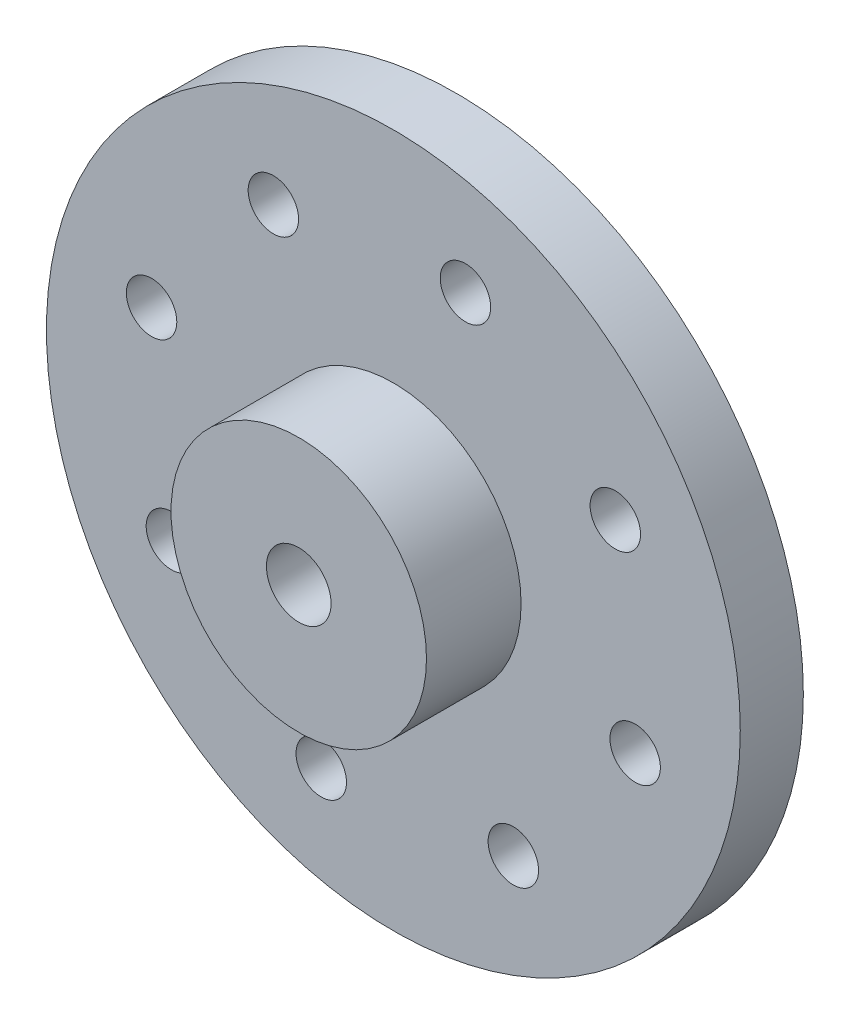
ISO-10303-21;
HEADER;
FILE_DESCRIPTION(('STEP AP214'),'2;1');
FILE_NAME('part.step','',(''),(''),'','','');
FILE_SCHEMA(('AUTOMOTIVE_DESIGN { 1 0 10303 214 1 1 1 1 }'));
ENDSEC;
DATA;
#1=APPLICATION_CONTEXT('core data for automotive mechanical design processes');
#2=APPLICATION_PROTOCOL_DEFINITION('international standard','automotive_design',2000,#1);
#3=PRODUCT_CONTEXT('',#1,'mechanical');
#4=PRODUCT('Part','Part','',(#3));
#5=PRODUCT_RELATED_PRODUCT_CATEGORY('part','',(#4));
#6=PRODUCT_DEFINITION_FORMATION('','',#4);
#7=PRODUCT_DEFINITION_CONTEXT('part definition',#1,'design');
#8=PRODUCT_DEFINITION('design','',#6,#7);
#9=PRODUCT_DEFINITION_SHAPE('','',#8);
#10=(LENGTH_UNIT() NAMED_UNIT(*) SI_UNIT(.MILLI.,.METRE.));
#11=(NAMED_UNIT(*) PLANE_ANGLE_UNIT() SI_UNIT($,.RADIAN.));
#12=(NAMED_UNIT(*) SI_UNIT($,.STERADIAN.) SOLID_ANGLE_UNIT());
#13=UNCERTAINTY_MEASURE_WITH_UNIT(LENGTH_MEASURE(1.E-05),#10,'distance_accuracy_value','');
#14=(GEOMETRIC_REPRESENTATION_CONTEXT(3) GLOBAL_UNCERTAINTY_ASSIGNED_CONTEXT((#13)) GLOBAL_UNIT_ASSIGNED_CONTEXT((#10,
#11,#12)) REPRESENTATION_CONTEXT('',''));
#15=CARTESIAN_POINT('',(0.,0.,0.));
#16=DIRECTION('',(0.,0.,1.));
#17=DIRECTION('',(1.,0.,0.));
#18=AXIS2_PLACEMENT_3D('',#15,#16,#17);
#19=CARTESIAN_POINT('',(0.,0.,0.));
#20=DIRECTION('',(0.,0.,1.));
#21=DIRECTION('',(1.,0.,0.));
#22=AXIS2_PLACEMENT_3D('',#19,#20,#21);
#23=PLANE('',#22);
#24=CARTESIAN_POINT('',(2.28618864815034,7.66637733646528,0.));
#25=DIRECTION('',(0.,0.,1.));
#26=DIRECTION('',(1.,0.,0.));
#27=AXIS2_PLACEMENT_3D('',#24,#25,#26);
#28=CIRCLE('',#27,0.799999999999994);
#29=CARTESIAN_POINT('',(3.08618864815033,7.66637733646528,0.));
#30=VERTEX_POINT('',#29);
#31=EDGE_CURVE('E109',#30,#30,#28,.T.);
#32=ORIENTED_EDGE('',*,*,#31,.T.);
#33=EDGE_LOOP('',(#32));
#34=FACE_BOUND('',#33,.T.);
#35=CARTESIAN_POINT('',(7.03752689792844,3.80436790557086,0.));
#36=DIRECTION('',(0.,0.,1.));
#37=DIRECTION('',(1.,0.,0.));
#38=AXIS2_PLACEMENT_3D('',#35,#36,#37);
#39=CIRCLE('',#38,0.799999999999994);
#40=CARTESIAN_POINT('',(7.83752689792843,3.80436790557086,0.));
#41=VERTEX_POINT('',#40);
#42=EDGE_CURVE('E103',#41,#41,#39,.T.);
#43=ORIENTED_EDGE('',*,*,#42,.T.);
#44=EDGE_LOOP('',(#43));
#45=FACE_BOUND('',#44,.T.);
#46=CARTESIAN_POINT('',(7.66637733646571,-2.28618864815011,0.));
#47=DIRECTION('',(0.,0.,1.));
#48=DIRECTION('',(1.,0.,0.));
#49=AXIS2_PLACEMENT_3D('',#46,#47,#48);
#50=CIRCLE('',#49,0.799999999999994);
#51=CARTESIAN_POINT('',(8.4663773364657,-2.28618864815011,0.));
#52=VERTEX_POINT('',#51);
#53=EDGE_CURVE('E97',#52,#52,#50,.T.);
#54=ORIENTED_EDGE('',*,*,#53,.T.);
#55=EDGE_LOOP('',(#54));
#56=FACE_BOUND('',#55,.T.);
#57=CARTESIAN_POINT('',(3.80436790557128,-7.03752689792821,0.));
#58=DIRECTION('',(0.,0.,1.));
#59=DIRECTION('',(1.,0.,0.));
#60=AXIS2_PLACEMENT_3D('',#57,#58,#59);
#61=CIRCLE('',#60,0.799999999999994);
#62=CARTESIAN_POINT('',(4.60436790557128,-7.03752689792821,0.));
#63=VERTEX_POINT('',#62);
#64=EDGE_CURVE('E91',#63,#63,#61,.T.);
#65=ORIENTED_EDGE('',*,*,#64,.T.);
#66=EDGE_LOOP('',(#65));
#67=FACE_BOUND('',#66,.T.);
#68=CARTESIAN_POINT('',(-2.28618864814968,-7.66637733646548,0.));
#69=DIRECTION('',(0.,0.,1.));
#70=DIRECTION('',(1.,0.,0.));
#71=AXIS2_PLACEMENT_3D('',#68,#69,#70);
#72=CIRCLE('',#71,0.799999999999994);
#73=CARTESIAN_POINT('',(-1.48618864814969,-7.66637733646548,0.));
#74=VERTEX_POINT('',#73);
#75=EDGE_CURVE('E85',#74,#74,#72,.T.);
#76=ORIENTED_EDGE('',*,*,#75,.T.);
#77=EDGE_LOOP('',(#76));
#78=FACE_BOUND('',#77,.T.);
#79=CARTESIAN_POINT('',(-7.03752689792779,-3.80436790557105,0.));
#80=DIRECTION('',(0.,0.,1.));
#81=DIRECTION('',(1.,0.,0.));
#82=AXIS2_PLACEMENT_3D('',#79,#80,#81);
#83=CIRCLE('',#82,0.799999999999993);
#84=CARTESIAN_POINT('',(-6.23752689792779,-3.80436790557105,0.));
#85=VERTEX_POINT('',#84);
#86=EDGE_CURVE('E79',#85,#85,#83,.T.);
#87=ORIENTED_EDGE('',*,*,#86,.T.);
#88=EDGE_LOOP('',(#87));
#89=FACE_BOUND('',#88,.T.);
#90=CARTESIAN_POINT('',(-7.66637733646505,2.28618864814991,0.));
#91=DIRECTION('',(0.,0.,1.));
#92=DIRECTION('',(1.,0.,0.));
#93=AXIS2_PLACEMENT_3D('',#90,#91,#92);
#94=CIRCLE('',#93,0.799999999999993);
#95=CARTESIAN_POINT('',(-6.86637733646506,2.28618864814991,0.));
#96=VERTEX_POINT('',#95);
#97=EDGE_CURVE('E73',#96,#96,#94,.T.);
#98=ORIENTED_EDGE('',*,*,#97,.T.);
#99=EDGE_LOOP('',(#98));
#100=FACE_BOUND('',#99,.T.);
#101=CARTESIAN_POINT('',(-3.80436790557063,7.03752689792801,0.));
#102=DIRECTION('',(0.,0.,1.));
#103=DIRECTION('',(1.,0.,0.));
#104=AXIS2_PLACEMENT_3D('',#101,#102,#103);
#105=CIRCLE('',#104,0.799999999999994);
#106=CARTESIAN_POINT('',(-3.00436790557064,7.03752689792801,0.));
#107=VERTEX_POINT('',#106);
#108=EDGE_CURVE('E67',#107,#107,#105,.T.);
#109=ORIENTED_EDGE('',*,*,#108,.T.);
#110=EDGE_LOOP('',(#109));
#111=FACE_BOUND('',#110,.T.);
#112=CARTESIAN_POINT('',(0.,0.,0.));
#113=DIRECTION('',(0.,0.,1.));
#114=DIRECTION('',(1.,0.,0.));
#115=AXIS2_PLACEMENT_3D('',#112,#113,#114);
#116=CIRCLE('',#115,11.);
#117=CARTESIAN_POINT('',(11.,0.,0.));
#118=VERTEX_POINT('',#117);
#119=EDGE_CURVE('E50',#118,#118,#116,.T.);
#120=ORIENTED_EDGE('',*,*,#119,.F.);
#121=EDGE_LOOP('',(#120));
#122=FACE_BOUND('',#121,.T.);
#123=CARTESIAN_POINT('',(0.,0.,0.));
#124=DIRECTION('',(0.,0.,1.));
#125=DIRECTION('',(1.,0.,0.));
#126=AXIS2_PLACEMENT_3D('',#123,#124,#125);
#127=CIRCLE('',#126,4.);
#128=CARTESIAN_POINT('',(4.,0.,0.));
#129=VERTEX_POINT('',#128);
#130=EDGE_CURVE('E43',#129,#129,#127,.F.);
#131=ORIENTED_EDGE('',*,*,#130,.F.);
#132=EDGE_LOOP('',(#131));
#133=FACE_BOUND('',#132,.T.);
#134=ADVANCED_FACE('F32',(#34,#45,#56,#67,#78,#89,#100,#111,#122,#133),#23,.F.);
#135=CARTESIAN_POINT('',(0.,0.,2.));
#136=DIRECTION('',(0.,0.,1.));
#137=DIRECTION('',(1.,0.,0.));
#138=AXIS2_PLACEMENT_3D('',#135,#136,#137);
#139=PLANE('',#138);
#140=CARTESIAN_POINT('',(2.28618864815034,7.66637733646528,2.));
#141=DIRECTION('',(0.,0.,1.));
#142=DIRECTION('',(1.,0.,0.));
#143=AXIS2_PLACEMENT_3D('',#140,#141,#142);
#144=CIRCLE('',#143,0.799999999999988);
#145=CARTESIAN_POINT('',(3.08618864815033,7.66637733646528,2.));
#146=VERTEX_POINT('',#145);
#147=EDGE_CURVE('E112',#146,#146,#144,.T.);
#148=ORIENTED_EDGE('',*,*,#147,.F.);
#149=EDGE_LOOP('',(#148));
#150=FACE_BOUND('',#149,.T.);
#151=CARTESIAN_POINT('',(7.03752689792844,3.80436790557086,2.));
#152=DIRECTION('',(0.,0.,1.));
#153=DIRECTION('',(1.,0.,0.));
#154=AXIS2_PLACEMENT_3D('',#151,#152,#153);
#155=CIRCLE('',#154,0.799999999999989);
#156=CARTESIAN_POINT('',(7.83752689792843,3.80436790557086,2.));
#157=VERTEX_POINT('',#156);
#158=EDGE_CURVE('E106',#157,#157,#155,.T.);
#159=ORIENTED_EDGE('',*,*,#158,.F.);
#160=EDGE_LOOP('',(#159));
#161=FACE_BOUND('',#160,.T.);
#162=CARTESIAN_POINT('',(7.66637733646571,-2.28618864815011,2.));
#163=DIRECTION('',(0.,0.,1.));
#164=DIRECTION('',(1.,0.,0.));
#165=AXIS2_PLACEMENT_3D('',#162,#163,#164);
#166=CIRCLE('',#165,0.799999999999989);
#167=CARTESIAN_POINT('',(8.4663773364657,-2.28618864815011,2.));
#168=VERTEX_POINT('',#167);
#169=EDGE_CURVE('E100',#168,#168,#166,.T.);
#170=ORIENTED_EDGE('',*,*,#169,.F.);
#171=EDGE_LOOP('',(#170));
#172=FACE_BOUND('',#171,.T.);
#173=CARTESIAN_POINT('',(3.80436790557128,-7.03752689792821,2.));
#174=DIRECTION('',(0.,0.,1.));
#175=DIRECTION('',(1.,0.,0.));
#176=AXIS2_PLACEMENT_3D('',#173,#174,#175);
#177=CIRCLE('',#176,0.799999999999989);
#178=CARTESIAN_POINT('',(4.60436790557127,-7.03752689792821,2.));
#179=VERTEX_POINT('',#178);
#180=EDGE_CURVE('E94',#179,#179,#177,.T.);
#181=ORIENTED_EDGE('',*,*,#180,.F.);
#182=EDGE_LOOP('',(#181));
#183=FACE_BOUND('',#182,.T.);
#184=CARTESIAN_POINT('',(-2.28618864814968,-7.66637733646548,2.));
#185=DIRECTION('',(0.,0.,1.));
#186=DIRECTION('',(1.,0.,0.));
#187=AXIS2_PLACEMENT_3D('',#184,#185,#186);
#188=CIRCLE('',#187,0.799999999999988);
#189=CARTESIAN_POINT('',(-1.4861886481497,-7.66637733646548,2.));
#190=VERTEX_POINT('',#189);
#191=EDGE_CURVE('E88',#190,#190,#188,.T.);
#192=ORIENTED_EDGE('',*,*,#191,.F.);
#193=EDGE_LOOP('',(#192));
#194=FACE_BOUND('',#193,.T.);
#195=CARTESIAN_POINT('',(-7.03752689792779,-3.80436790557105,2.));
#196=DIRECTION('',(0.,0.,1.));
#197=DIRECTION('',(1.,0.,0.));
#198=AXIS2_PLACEMENT_3D('',#195,#196,#197);
#199=CIRCLE('',#198,0.799999999999988);
#200=CARTESIAN_POINT('',(-6.2375268979278,-3.80436790557105,2.));
#201=VERTEX_POINT('',#200);
#202=EDGE_CURVE('E82',#201,#201,#199,.T.);
#203=ORIENTED_EDGE('',*,*,#202,.F.);
#204=EDGE_LOOP('',(#203));
#205=FACE_BOUND('',#204,.T.);
#206=CARTESIAN_POINT('',(-7.66637733646505,2.28618864814991,2.));
#207=DIRECTION('',(0.,0.,1.));
#208=DIRECTION('',(1.,0.,0.));
#209=AXIS2_PLACEMENT_3D('',#206,#207,#208);
#210=CIRCLE('',#209,0.799999999999988);
#211=CARTESIAN_POINT('',(-6.86637733646507,2.28618864814991,2.));
#212=VERTEX_POINT('',#211);
#213=EDGE_CURVE('E76',#212,#212,#210,.T.);
#214=ORIENTED_EDGE('',*,*,#213,.F.);
#215=EDGE_LOOP('',(#214));
#216=FACE_BOUND('',#215,.T.);
#217=CARTESIAN_POINT('',(-3.80436790557063,7.03752689792801,2.));
#218=DIRECTION('',(0.,0.,1.));
#219=DIRECTION('',(1.,0.,0.));
#220=AXIS2_PLACEMENT_3D('',#217,#218,#219);
#221=CIRCLE('',#220,0.799999999999988);
#222=CARTESIAN_POINT('',(-3.00436790557064,7.03752689792801,2.));
#223=VERTEX_POINT('',#222);
#224=EDGE_CURVE('E70',#223,#223,#221,.T.);
#225=ORIENTED_EDGE('',*,*,#224,.F.);
#226=EDGE_LOOP('',(#225));
#227=FACE_BOUND('',#226,.T.);
#228=CARTESIAN_POINT('',(0.,0.,2.));
#229=DIRECTION('',(0.,0.,1.));
#230=DIRECTION('',(1.,0.,0.));
#231=AXIS2_PLACEMENT_3D('',#228,#229,#230);
#232=CIRCLE('',#231,11.);
#233=CARTESIAN_POINT('',(11.,0.,2.));
#234=VERTEX_POINT('',#233);
#235=EDGE_CURVE('E47',#234,#234,#232,.T.);
#236=ORIENTED_EDGE('',*,*,#235,.T.);
#237=EDGE_LOOP('',(#236));
#238=FACE_BOUND('',#237,.T.);
#239=CARTESIAN_POINT('',(0.,0.,2.));
#240=DIRECTION('',(0.,0.,1.));
#241=DIRECTION('',(1.,0.,0.));
#242=AXIS2_PLACEMENT_3D('',#239,#240,#241);
#243=CIRCLE('',#242,4.05);
#244=CARTESIAN_POINT('',(4.05,0.,2.));
#245=VERTEX_POINT('',#244);
#246=EDGE_CURVE('E59',#245,#245,#243,.T.);
#247=ORIENTED_EDGE('',*,*,#246,.F.);
#248=EDGE_LOOP('',(#247));
#249=FACE_BOUND('',#248,.T.);
#250=ADVANCED_FACE('F139',(#150,#161,#172,#183,#194,#205,#216,#227,#238,#249),#139,.T.);
#251=CARTESIAN_POINT('',(0.,0.,2.));
#252=DIRECTION('',(0.,0.,-1.));
#253=DIRECTION('',(-1.,0.,0.));
#254=AXIS2_PLACEMENT_3D('',#251,#252,#253);
#255=CYLINDRICAL_SURFACE('',#254,11.);
#256=ORIENTED_EDGE('',*,*,#235,.F.);
#257=EDGE_LOOP('',(#256));
#258=FACE_BOUND('',#257,.T.);
#259=ORIENTED_EDGE('',*,*,#119,.T.);
#260=EDGE_LOOP('',(#259));
#261=FACE_BOUND('',#260,.T.);
#262=ADVANCED_FACE('F135',(#258,#261),#255,.T.);
#263=CARTESIAN_POINT('',(0.,0.,5.));
#264=DIRECTION('',(0.,0.,-1.));
#265=DIRECTION('',(-1.,0.,0.));
#266=AXIS2_PLACEMENT_3D('',#263,#264,#265);
#267=CYLINDRICAL_SURFACE('',#266,4.05);
#268=CARTESIAN_POINT('',(0.,0.,5.));
#269=DIRECTION('',(0.,0.,1.));
#270=DIRECTION('',(1.,0.,0.));
#271=AXIS2_PLACEMENT_3D('',#268,#269,#270);
#272=CIRCLE('',#271,4.05);
#273=CARTESIAN_POINT('',(4.05,0.,5.));
#274=VERTEX_POINT('',#273);
#275=EDGE_CURVE('E58',#274,#274,#272,.T.);
#276=ORIENTED_EDGE('',*,*,#275,.F.);
#277=EDGE_LOOP('',(#276));
#278=FACE_BOUND('',#277,.T.);
#279=ORIENTED_EDGE('',*,*,#246,.T.);
#280=EDGE_LOOP('',(#279));
#281=FACE_BOUND('',#280,.T.);
#282=ADVANCED_FACE('F129',(#278,#281),#267,.T.);
#283=CARTESIAN_POINT('',(0.,0.,5.));
#284=DIRECTION('',(0.,0.,1.));
#285=DIRECTION('',(1.,0.,0.));
#286=AXIS2_PLACEMENT_3D('',#283,#284,#285);
#287=PLANE('',#286);
#288=CARTESIAN_POINT('',(0.,0.,5.));
#289=DIRECTION('',(0.,0.,1.));
#290=DIRECTION('',(1.,0.,0.));
#291=AXIS2_PLACEMENT_3D('',#288,#289,#290);
#292=CIRCLE('',#291,1.025);
#293=CARTESIAN_POINT('',(1.025,0.,5.));
#294=VERTEX_POINT('',#293);
#295=EDGE_CURVE('E118',#294,#294,#292,.T.);
#296=ORIENTED_EDGE('',*,*,#295,.F.);
#297=EDGE_LOOP('',(#296));
#298=FACE_BOUND('',#297,.T.);
#299=ORIENTED_EDGE('',*,*,#275,.T.);
#300=EDGE_LOOP('',(#299));
#301=FACE_BOUND('',#300,.T.);
#302=ADVANCED_FACE('F125',(#298,#301),#287,.T.);
#303=CARTESIAN_POINT('',(0.,0.,-1.));
#304=DIRECTION('',(0.,0.,-1.));
#305=DIRECTION('',(-1.,0.,0.));
#306=AXIS2_PLACEMENT_3D('',#303,#304,#305);
#307=PLANE('',#306);
#308=CARTESIAN_POINT('',(0.,0.,-1.));
#309=DIRECTION('',(0.,0.,-1.));
#310=DIRECTION('',(-1.,0.,0.));
#311=AXIS2_PLACEMENT_3D('',#308,#309,#310);
#312=CIRCLE('',#311,3.40000000000001);
#313=CARTESIAN_POINT('',(-3.40000000000001,0.,-1.));
#314=VERTEX_POINT('',#313);
#315=EDGE_CURVE('E39',#314,#314,#312,.T.);
#316=ORIENTED_EDGE('',*,*,#315,.T.);
#317=EDGE_LOOP('',(#316));
#318=FACE_BOUND('',#317,.T.);
#319=CARTESIAN_POINT('',(0.,0.,-1.));
#320=DIRECTION('',(0.,0.,-1.));
#321=DIRECTION('',(-1.,0.,0.));
#322=AXIS2_PLACEMENT_3D('',#319,#320,#321);
#323=CIRCLE('',#322,2.66985821517932);
#324=CARTESIAN_POINT('',(-2.66985821517932,0.,-1.));
#325=VERTEX_POINT('',#324);
#326=EDGE_CURVE('E62',#325,#325,#323,.T.);
#327=ORIENTED_EDGE('',*,*,#326,.F.);
#328=EDGE_LOOP('',(#327));
#329=FACE_BOUND('',#328,.T.);
#330=ADVANCED_FACE('F128',(#318,#329),#307,.T.);
#331=CARTESIAN_POINT('',(0.,0.,-1.));
#332=DIRECTION('',(0.,0.,1.));
#333=DIRECTION('',(1.,0.,0.));
#334=AXIS2_PLACEMENT_3D('',#331,#332,#333);
#335=CYLINDRICAL_SURFACE('',#334,4.);
#336=CARTESIAN_POINT('',(0.,0.,-0.400000000000002));
#337=DIRECTION('',(0.,0.,-1.));
#338=DIRECTION('',(-1.,0.,0.));
#339=AXIS2_PLACEMENT_3D('',#336,#337,#338);
#340=CIRCLE('',#339,4.);
#341=CARTESIAN_POINT('',(-4.,0.,-0.400000000000002));
#342=VERTEX_POINT('',#341);
#343=EDGE_CURVE('E10',#342,#342,#340,.F.);
#344=ORIENTED_EDGE('',*,*,#343,.T.);
#345=EDGE_LOOP('',(#344));
#346=FACE_BOUND('',#345,.T.);
#347=ORIENTED_EDGE('',*,*,#130,.T.);
#348=EDGE_LOOP('',(#347));
#349=FACE_BOUND('',#348,.T.);
#350=ADVANCED_FACE('F159',(#346,#349),#335,.T.);
#351=CARTESIAN_POINT('',(0.,0.,2.));
#352=DIRECTION('',(0.,0.,1.));
#353=DIRECTION('',(1.,0.,0.));
#354=AXIS2_PLACEMENT_3D('',#351,#352,#353);
#355=PLANE('',#354);
#356=CARTESIAN_POINT('',(0.,0.,2.));
#357=DIRECTION('',(0.,0.,1.));
#358=DIRECTION('',(1.,0.,0.));
#359=AXIS2_PLACEMENT_3D('',#356,#357,#358);
#360=CIRCLE('',#359,1.025);
#361=CARTESIAN_POINT('',(1.025,0.,2.));
#362=VERTEX_POINT('',#361);
#363=EDGE_CURVE('E115',#362,#362,#360,.T.);
#364=ORIENTED_EDGE('',*,*,#363,.T.);
#365=EDGE_LOOP('',(#364));
#366=FACE_BOUND('',#365,.T.);
#367=CARTESIAN_POINT('',(0.,0.,2.));
#368=DIRECTION('',(0.,0.,1.));
#369=DIRECTION('',(1.,0.,0.));
#370=AXIS2_PLACEMENT_3D('',#367,#368,#369);
#371=CIRCLE('',#370,2.66985821517932);
#372=CARTESIAN_POINT('',(2.66985821517932,0.,2.));
#373=VERTEX_POINT('',#372);
#374=EDGE_CURVE('E53',#373,#373,#371,.T.);
#375=ORIENTED_EDGE('',*,*,#374,.F.);
#376=EDGE_LOOP('',(#375));
#377=FACE_BOUND('',#376,.T.);
#378=ADVANCED_FACE('F155',(#366,#377),#355,.F.);
#379=CARTESIAN_POINT('',(0.,0.,2.));
#380=DIRECTION('',(0.,0.,-1.));
#381=DIRECTION('',(-1.,0.,0.));
#382=AXIS2_PLACEMENT_3D('',#379,#380,#381);
#383=CYLINDRICAL_SURFACE('',#382,2.66985821517932);
#384=ORIENTED_EDGE('',*,*,#374,.T.);
#385=EDGE_LOOP('',(#384));
#386=FACE_BOUND('',#385,.T.);
#387=ORIENTED_EDGE('',*,*,#326,.T.);
#388=EDGE_LOOP('',(#387));
#389=FACE_BOUND('',#388,.T.);
#390=ADVANCED_FACE('F153',(#386,#389),#383,.F.);
#391=CARTESIAN_POINT('',(0.,0.,-1.));
#392=DIRECTION('',(0.,0.,1.));
#393=DIRECTION('',(1.,0.,0.));
#394=AXIS2_PLACEMENT_3D('',#391,#392,#393);
#395=CONICAL_SURFACE('',#394,3.40000000000001,0.785398163397444);
#396=ORIENTED_EDGE('',*,*,#343,.F.);
#397=EDGE_LOOP('',(#396));
#398=FACE_BOUND('',#397,.T.);
#399=ORIENTED_EDGE('',*,*,#315,.F.);
#400=EDGE_LOOP('',(#399));
#401=FACE_BOUND('',#400,.T.);
#402=ADVANCED_FACE('F34',(#398,#401),#395,.T.);
#403=CARTESIAN_POINT('',(-3.80436790557063,7.03752689792801,2.));
#404=DIRECTION('',(0.,0.,1.));
#405=DIRECTION('',(1.,0.,0.));
#406=AXIS2_PLACEMENT_3D('',#403,#404,#405);
#407=CYLINDRICAL_SURFACE('',#406,0.799999999999994);
#408=ORIENTED_EDGE('',*,*,#224,.T.);
#409=EDGE_LOOP('',(#408));
#410=FACE_BOUND('',#409,.T.);
#411=ORIENTED_EDGE('',*,*,#108,.F.);
#412=EDGE_LOOP('',(#411));
#413=FACE_BOUND('',#412,.T.);
#414=ADVANCED_FACE('F166',(#410,#413),#407,.F.);
#415=CARTESIAN_POINT('',(-7.66637733646505,2.28618864814991,2.));
#416=DIRECTION('',(0.,0.,1.));
#417=DIRECTION('',(1.,0.,0.));
#418=AXIS2_PLACEMENT_3D('',#415,#416,#417);
#419=CYLINDRICAL_SURFACE('',#418,0.799999999999993);
#420=ORIENTED_EDGE('',*,*,#213,.T.);
#421=EDGE_LOOP('',(#420));
#422=FACE_BOUND('',#421,.T.);
#423=ORIENTED_EDGE('',*,*,#97,.F.);
#424=EDGE_LOOP('',(#423));
#425=FACE_BOUND('',#424,.T.);
#426=ADVANCED_FACE('F169',(#422,#425),#419,.F.);
#427=CARTESIAN_POINT('',(-7.03752689792779,-3.80436790557105,2.));
#428=DIRECTION('',(0.,0.,1.));
#429=DIRECTION('',(1.,0.,0.));
#430=AXIS2_PLACEMENT_3D('',#427,#428,#429);
#431=CYLINDRICAL_SURFACE('',#430,0.799999999999993);
#432=ORIENTED_EDGE('',*,*,#202,.T.);
#433=EDGE_LOOP('',(#432));
#434=FACE_BOUND('',#433,.T.);
#435=ORIENTED_EDGE('',*,*,#86,.F.);
#436=EDGE_LOOP('',(#435));
#437=FACE_BOUND('',#436,.T.);
#438=ADVANCED_FACE('F173',(#434,#437),#431,.F.);
#439=CARTESIAN_POINT('',(-2.28618864814968,-7.66637733646548,2.));
#440=DIRECTION('',(0.,0.,1.));
#441=DIRECTION('',(1.,0.,0.));
#442=AXIS2_PLACEMENT_3D('',#439,#440,#441);
#443=CYLINDRICAL_SURFACE('',#442,0.799999999999994);
#444=ORIENTED_EDGE('',*,*,#191,.T.);
#445=EDGE_LOOP('',(#444));
#446=FACE_BOUND('',#445,.T.);
#447=ORIENTED_EDGE('',*,*,#75,.F.);
#448=EDGE_LOOP('',(#447));
#449=FACE_BOUND('',#448,.T.);
#450=ADVANCED_FACE('F177',(#446,#449),#443,.F.);
#451=CARTESIAN_POINT('',(3.80436790557128,-7.03752689792821,2.));
#452=DIRECTION('',(0.,0.,1.));
#453=DIRECTION('',(1.,0.,0.));
#454=AXIS2_PLACEMENT_3D('',#451,#452,#453);
#455=CYLINDRICAL_SURFACE('',#454,0.799999999999994);
#456=ORIENTED_EDGE('',*,*,#180,.T.);
#457=EDGE_LOOP('',(#456));
#458=FACE_BOUND('',#457,.T.);
#459=ORIENTED_EDGE('',*,*,#64,.F.);
#460=EDGE_LOOP('',(#459));
#461=FACE_BOUND('',#460,.T.);
#462=ADVANCED_FACE('F181',(#458,#461),#455,.F.);
#463=CARTESIAN_POINT('',(7.66637733646571,-2.28618864815011,2.));
#464=DIRECTION('',(0.,0.,1.));
#465=DIRECTION('',(1.,0.,0.));
#466=AXIS2_PLACEMENT_3D('',#463,#464,#465);
#467=CYLINDRICAL_SURFACE('',#466,0.799999999999994);
#468=ORIENTED_EDGE('',*,*,#169,.T.);
#469=EDGE_LOOP('',(#468));
#470=FACE_BOUND('',#469,.T.);
#471=ORIENTED_EDGE('',*,*,#53,.F.);
#472=EDGE_LOOP('',(#471));
#473=FACE_BOUND('',#472,.T.);
#474=ADVANCED_FACE('F185',(#470,#473),#467,.F.);
#475=CARTESIAN_POINT('',(7.03752689792844,3.80436790557086,2.));
#476=DIRECTION('',(0.,0.,1.));
#477=DIRECTION('',(1.,0.,0.));
#478=AXIS2_PLACEMENT_3D('',#475,#476,#477);
#479=CYLINDRICAL_SURFACE('',#478,0.799999999999994);
#480=ORIENTED_EDGE('',*,*,#158,.T.);
#481=EDGE_LOOP('',(#480));
#482=FACE_BOUND('',#481,.T.);
#483=ORIENTED_EDGE('',*,*,#42,.F.);
#484=EDGE_LOOP('',(#483));
#485=FACE_BOUND('',#484,.T.);
#486=ADVANCED_FACE('F189',(#482,#485),#479,.F.);
#487=CARTESIAN_POINT('',(2.28618864815034,7.66637733646528,2.));
#488=DIRECTION('',(0.,0.,1.));
#489=DIRECTION('',(1.,0.,0.));
#490=AXIS2_PLACEMENT_3D('',#487,#488,#489);
#491=CYLINDRICAL_SURFACE('',#490,0.799999999999994);
#492=ORIENTED_EDGE('',*,*,#147,.T.);
#493=EDGE_LOOP('',(#492));
#494=FACE_BOUND('',#493,.T.);
#495=ORIENTED_EDGE('',*,*,#31,.F.);
#496=EDGE_LOOP('',(#495));
#497=FACE_BOUND('',#496,.T.);
#498=ADVANCED_FACE('F193',(#494,#497),#491,.F.);
#499=CARTESIAN_POINT('',(0.,0.,5.));
#500=DIRECTION('',(0.,0.,1.));
#501=DIRECTION('',(1.,0.,0.));
#502=AXIS2_PLACEMENT_3D('',#499,#500,#501);
#503=CYLINDRICAL_SURFACE('',#502,1.025);
#504=ORIENTED_EDGE('',*,*,#295,.T.);
#505=EDGE_LOOP('',(#504));
#506=FACE_BOUND('',#505,.T.);
#507=ORIENTED_EDGE('',*,*,#363,.F.);
#508=EDGE_LOOP('',(#507));
#509=FACE_BOUND('',#508,.T.);
#510=ADVANCED_FACE('F122',(#506,#509),#503,.F.);
#511=CLOSED_SHELL('',(#134,#250,#262,#282,#302,#330,#350,#378,#390,#402,#414,#426,#438,#450,
#462,#474,#486,#498,#510));
#512=MANIFOLD_SOLID_BREP('B2',#511);
#513=ADVANCED_BREP_SHAPE_REPRESENTATION('',(#18,#512),#14);
#514=SHAPE_DEFINITION_REPRESENTATION(#9,#513);
ENDSEC;
END-ISO-10303-21;
